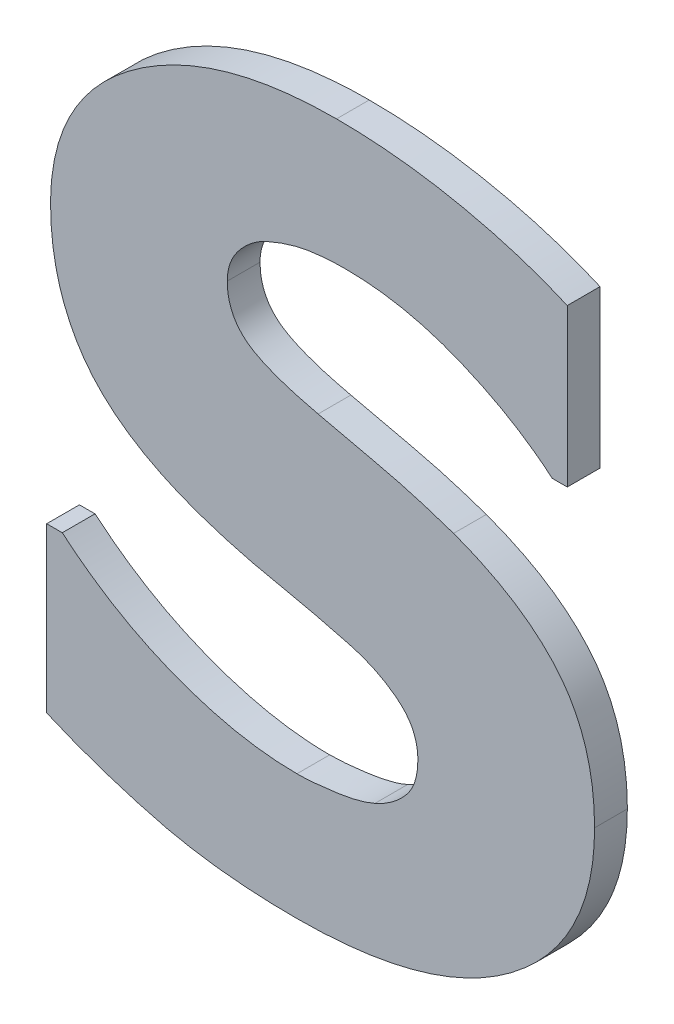
ISO-10303-21;
HEADER;
FILE_DESCRIPTION(('STEP AP214'),'2;1');
FILE_NAME('part.step','',(''),(''),'','','');
FILE_SCHEMA(('AUTOMOTIVE_DESIGN { 1 0 10303 214 1 1 1 1 }'));
ENDSEC;
DATA;
#1=APPLICATION_CONTEXT('core data for automotive mechanical design processes');
#2=APPLICATION_PROTOCOL_DEFINITION('international standard','automotive_design',2000,#1);
#3=PRODUCT_CONTEXT('',#1,'mechanical');
#4=PRODUCT('Part','Part','',(#3));
#5=PRODUCT_RELATED_PRODUCT_CATEGORY('part','',(#4));
#6=PRODUCT_DEFINITION_FORMATION('','',#4);
#7=PRODUCT_DEFINITION_CONTEXT('part definition',#1,'design');
#8=PRODUCT_DEFINITION('design','',#6,#7);
#9=PRODUCT_DEFINITION_SHAPE('','',#8);
#10=(LENGTH_UNIT() NAMED_UNIT(*) SI_UNIT(.MILLI.,.METRE.));
#11=(NAMED_UNIT(*) PLANE_ANGLE_UNIT() SI_UNIT($,.RADIAN.));
#12=(NAMED_UNIT(*) SI_UNIT($,.STERADIAN.) SOLID_ANGLE_UNIT());
#13=UNCERTAINTY_MEASURE_WITH_UNIT(LENGTH_MEASURE(1.E-05),#10,'distance_accuracy_value','');
#14=(GEOMETRIC_REPRESENTATION_CONTEXT(3) GLOBAL_UNCERTAINTY_ASSIGNED_CONTEXT((#13)) GLOBAL_UNIT_ASSIGNED_CONTEXT((#10,
#11,#12)) REPRESENTATION_CONTEXT('',''));
#15=CARTESIAN_POINT('',(0.,0.,0.));
#16=DIRECTION('',(0.,0.,1.));
#17=DIRECTION('',(1.,0.,0.));
#18=AXIS2_PLACEMENT_3D('',#15,#16,#17);
#19=CARTESIAN_POINT('',(3.989109626945,-3.1542803303733,0.0475));
#20=DIRECTION('',(-1.,0.,0.));
#21=DIRECTION('',(0.,-1.,0.));
#22=AXIS2_PLACEMENT_3D('',#19,#20,#21);
#23=PLANE('',#22);
#24=DIRECTION('',(0.,1.,0.));
#25=VECTOR('',#24,1.);
#26=CARTESIAN_POINT('',(3.989109626945,-3.1792965370477,0.0475));
#27=LINE('',#26,#25);
#28=CARTESIAN_POINT('',(3.989109626945,-3.1792965370477,0.0475));
#29=VERTEX_POINT('',#28);
#30=CARTESIAN_POINT('',(3.989109626945,-3.1542803303733,0.0475));
#31=VERTEX_POINT('',#30);
#32=EDGE_CURVE('E11',#29,#31,#27,.T.);
#33=ORIENTED_EDGE('',*,*,#32,.F.);
#34=DIRECTION('',(0.,0.,1.));
#35=VECTOR('',#34,1.);
#36=CARTESIAN_POINT('',(3.989109626945,-3.1792965370477,0.0475));
#37=LINE('',#36,#35);
#38=CARTESIAN_POINT('',(3.989109626945,-3.1792965370477,0.0525));
#39=VERTEX_POINT('',#38);
#40=EDGE_CURVE('E24',#29,#39,#37,.T.);
#41=ORIENTED_EDGE('',*,*,#40,.T.);
#42=DIRECTION('',(0.,-1.,0.));
#43=VECTOR('',#42,1.);
#44=CARTESIAN_POINT('',(3.989109626945,-3.1792965370477,0.0525));
#45=LINE('',#44,#43);
#46=CARTESIAN_POINT('',(3.989109626945,-3.1542803303733,0.0525));
#47=VERTEX_POINT('',#46);
#48=EDGE_CURVE('E172',#47,#39,#45,.T.);
#49=ORIENTED_EDGE('',*,*,#48,.F.);
#50=DIRECTION('',(0.,0.,1.));
#51=VECTOR('',#50,1.);
#52=CARTESIAN_POINT('',(3.989109626945,-3.1542803303733,0.0475));
#53=LINE('',#52,#51);
#54=EDGE_CURVE('E469',#31,#47,#53,.T.);
#55=ORIENTED_EDGE('',*,*,#54,.F.);
#56=EDGE_LOOP('',(#33,#41,#49,#55));
#57=FACE_BOUND('',#56,.T.);
#58=ADVANCED_FACE('F17',(#57),#23,.T.);
#59=CARTESIAN_POINT('',(3.9914921228187,-3.1542803303733,0.0475));
#60=DIRECTION('',(0.,1.,0.));
#61=DIRECTION('',(-1.,0.,0.));
#62=AXIS2_PLACEMENT_3D('',#59,#60,#61);
#63=PLANE('',#62);
#64=DIRECTION('',(1.,0.,0.));
#65=VECTOR('',#64,1.);
#66=CARTESIAN_POINT('',(3.989109626945,-3.1542803303733,0.0475));
#67=LINE('',#66,#65);
#68=CARTESIAN_POINT('',(3.9914921228187,-3.1542803303733,0.0475));
#69=VERTEX_POINT('',#68);
#70=EDGE_CURVE('E467',#31,#69,#67,.T.);
#71=ORIENTED_EDGE('',*,*,#70,.F.);
#72=ORIENTED_EDGE('',*,*,#54,.T.);
#73=DIRECTION('',(-1.,0.,0.));
#74=VECTOR('',#73,1.);
#75=CARTESIAN_POINT('',(3.989109626945,-3.1542803303733,0.0525));
#76=LINE('',#75,#74);
#77=CARTESIAN_POINT('',(3.9914921228187,-3.1542803303733,0.0525));
#78=VERTEX_POINT('',#77);
#79=EDGE_CURVE('E465',#78,#47,#76,.T.);
#80=ORIENTED_EDGE('',*,*,#79,.F.);
#81=DIRECTION('',(0.,0.,1.));
#82=VECTOR('',#81,1.);
#83=CARTESIAN_POINT('',(3.9914921228187,-3.1542803303733,0.0475));
#84=LINE('',#83,#82);
#85=EDGE_CURVE('E459',#69,#78,#84,.T.);
#86=ORIENTED_EDGE('',*,*,#85,.F.);
#87=EDGE_LOOP('',(#71,#72,#80,#86));
#88=FACE_BOUND('',#87,.T.);
#89=ADVANCED_FACE('F539',(#88),#63,.T.);
#90=CARTESIAN_POINT('',(4.0273146500633,-3.1682349490624,0.0475));
#91=CARTESIAN_POINT('',(4.0273146500633,-3.1682349490624,0.0525));
#92=CARTESIAN_POINT('',(4.0183802905368,-3.1682349490624,0.0475));
#93=CARTESIAN_POINT('',(4.0183802905368,-3.1682349490624,0.0525));
#94=CARTESIAN_POINT('',(3.9994054126851,-3.1610023723028,0.0475));
#95=CARTESIAN_POINT('',(3.9994054126851,-3.1610023723028,0.0525));
#96=CARTESIAN_POINT('',(3.9914921228187,-3.1542803303733,0.0475));
#97=CARTESIAN_POINT('',(3.9914921228187,-3.1542803303733,0.0525));
#98=B_SPLINE_SURFACE_WITH_KNOTS('',2,1,((#90,#91),(#92,#93),(#94,#95),(#96,#97)),.UNSPECIFIED.,
.F.,.F.,.F.,(3,1,3),(2,2),(-2.,-1.,0.),(0.,0.01),.UNSPECIFIED.);
#99=CARTESIAN_POINT('',(3.9914921228187,-3.1542803303733,0.0475));
#100=CARTESIAN_POINT('',(3.9994054126851,-3.1610023723028,0.0475));
#101=CARTESIAN_POINT('',(4.0183802905368,-3.1682349490624,0.0475));
#102=CARTESIAN_POINT('',(4.0273146500633,-3.1682349490624,0.0475));
#103=B_SPLINE_CURVE_WITH_KNOTS('',2,(#99,#100,#101,#102),.UNSPECIFIED.,.F.,.F.,(3,1,3),(0.,1.,
2.),.UNSPECIFIED.);
#104=CARTESIAN_POINT('',(4.0273146500633,-3.1682349490624,0.0475));
#105=VERTEX_POINT('',#104);
#106=EDGE_CURVE('E452',#69,#105,#103,.T.);
#107=CARTESIAN_POINT('',(4.0273146500633,-3.1682349490624,0.0525));
#108=CARTESIAN_POINT('',(4.0183802905368,-3.1682349490624,0.0525));
#109=CARTESIAN_POINT('',(3.9994054126851,-3.1610023723028,0.0525));
#110=CARTESIAN_POINT('',(3.9914921228187,-3.1542803303733,0.0525));
#111=B_SPLINE_CURVE_WITH_KNOTS('',2,(#107,#108,#109,#110),.UNSPECIFIED.,.F.,.F.,(3,1,3),(-2.,
-1.,0.),.UNSPECIFIED.);
#112=CARTESIAN_POINT('',(4.0273146500633,-3.1682349490624,0.0525));
#113=VERTEX_POINT('',#112);
#114=EDGE_CURVE('E447',#113,#78,#111,.T.);
#115=DIRECTION('',(0.,0.,1.));
#116=VECTOR('',#115,1.);
#117=CARTESIAN_POINT('',(4.0273146500633,-3.1682349490624,0.0475));
#118=LINE('',#117,#116);
#119=EDGE_CURVE('E441',#105,#113,#118,.T.);
#120=ORIENTED_EDGE('',*,*,#106,.F.);
#121=ORIENTED_EDGE('',*,*,#85,.T.);
#122=ORIENTED_EDGE('',*,*,#114,.F.);
#123=ORIENTED_EDGE('',*,*,#119,.F.);
#124=EDGE_LOOP('',(#120,#121,#122,#123));
#125=FACE_BOUND('',#124,.T.);
#126=ADVANCED_FACE('F535',(#125),#98,.T.);
#127=CARTESIAN_POINT('',(4.0392271294321,-3.1661928097421,0.0475));
#128=CARTESIAN_POINT('',(4.0392271294321,-3.1661928097421,0.0525));
#129=CARTESIAN_POINT('',(4.037014811835,-3.1672138794022,0.0475));
#130=CARTESIAN_POINT('',(4.037014811835,-3.1672138794022,0.0525));
#131=CARTESIAN_POINT('',(4.0296120567987,-3.1682349490624,0.0475));
#132=CARTESIAN_POINT('',(4.0296120567987,-3.1682349490624,0.0525));
#133=CARTESIAN_POINT('',(4.0273146500633,-3.1682349490624,0.0475));
#134=CARTESIAN_POINT('',(4.0273146500633,-3.1682349490624,0.0525));
#135=B_SPLINE_SURFACE_WITH_KNOTS('',2,1,((#127,#128),(#129,#130),(#131,#132),(#133,#134)),
.UNSPECIFIED.,.F.,.F.,.F.,(3,1,3),(2,2),(-2.,-1.,0.),(0.,0.01),.UNSPECIFIED.);
#136=CARTESIAN_POINT('',(4.0273146500633,-3.1682349490624,0.0475));
#137=CARTESIAN_POINT('',(4.0296120567987,-3.1682349490624,0.0475));
#138=CARTESIAN_POINT('',(4.037014811835,-3.1672138794022,0.0475));
#139=CARTESIAN_POINT('',(4.0392271294321,-3.1661928097421,0.0475));
#140=B_SPLINE_CURVE_WITH_KNOTS('',2,(#136,#137,#138,#139),.UNSPECIFIED.,.F.,.F.,(3,1,3),(0.,1.,
2.),.UNSPECIFIED.);
#141=CARTESIAN_POINT('',(4.0392271294321,-3.1661928097421,0.0475));
#142=VERTEX_POINT('',#141);
#143=EDGE_CURVE('E434',#105,#142,#140,.T.);
#144=CARTESIAN_POINT('',(4.0392271294321,-3.1661928097421,0.0525));
#145=CARTESIAN_POINT('',(4.037014811835,-3.1672138794022,0.0525));
#146=CARTESIAN_POINT('',(4.0296120567987,-3.1682349490624,0.0525));
#147=CARTESIAN_POINT('',(4.0273146500633,-3.1682349490624,0.0525));
#148=B_SPLINE_CURVE_WITH_KNOTS('',2,(#144,#145,#146,#147),.UNSPECIFIED.,.F.,.F.,(3,1,3),(-2.,
-1.,0.),.UNSPECIFIED.);
#149=CARTESIAN_POINT('',(4.0392271294321,-3.1661928097421,0.0525));
#150=VERTEX_POINT('',#149);
#151=EDGE_CURVE('E429',#150,#113,#148,.T.);
#152=DIRECTION('',(0.,0.,1.));
#153=VECTOR('',#152,1.);
#154=CARTESIAN_POINT('',(4.0392271294321,-3.1661928097421,0.0475));
#155=LINE('',#154,#153);
#156=EDGE_CURVE('E423',#142,#150,#155,.T.);
#157=ORIENTED_EDGE('',*,*,#143,.F.);
#158=ORIENTED_EDGE('',*,*,#119,.T.);
#159=ORIENTED_EDGE('',*,*,#151,.F.);
#160=ORIENTED_EDGE('',*,*,#156,.F.);
#161=EDGE_LOOP('',(#157,#158,#159,#160));
#162=FACE_BOUND('',#161,.T.);
#163=ADVANCED_FACE('F531',(#162),#135,.T.);
#164=CARTESIAN_POINT('',(4.0457789930849,-3.1571733610771,0.0475));
#165=CARTESIAN_POINT('',(4.0457789930849,-3.1571733610771,0.0525));
#166=CARTESIAN_POINT('',(4.0457789930849,-3.1606620157494,0.0475));
#167=CARTESIAN_POINT('',(4.0457789930849,-3.1606620157494,0.0525));
#168=CARTESIAN_POINT('',(4.0419499818592,-3.1650015618052,0.0475));
#169=CARTESIAN_POINT('',(4.0419499818592,-3.1650015618052,0.0525));
#170=CARTESIAN_POINT('',(4.0392271294321,-3.1661928097421,0.0475));
#171=CARTESIAN_POINT('',(4.0392271294321,-3.1661928097421,0.0525));
#172=B_SPLINE_SURFACE_WITH_KNOTS('',2,1,((#164,#165),(#166,#167),(#168,#169),(#170,#171)),
.UNSPECIFIED.,.F.,.F.,.F.,(3,1,3),(2,2),(-2.,-1.,0.),(0.,0.01),.UNSPECIFIED.);
#173=CARTESIAN_POINT('',(4.0392271294321,-3.1661928097421,0.0475));
#174=CARTESIAN_POINT('',(4.0419499818592,-3.1650015618052,0.0475));
#175=CARTESIAN_POINT('',(4.0457789930849,-3.1606620157494,0.0475));
#176=CARTESIAN_POINT('',(4.0457789930849,-3.1571733610771,0.0475));
#177=B_SPLINE_CURVE_WITH_KNOTS('',2,(#173,#174,#175,#176),.UNSPECIFIED.,.F.,.F.,(3,1,3),(0.,1.,
2.),.UNSPECIFIED.);
#178=CARTESIAN_POINT('',(4.0457789930849,-3.1571733610771,0.0475));
#179=VERTEX_POINT('',#178);
#180=EDGE_CURVE('E416',#142,#179,#177,.T.);
#181=CARTESIAN_POINT('',(4.0457789930849,-3.1571733610771,0.0525));
#182=CARTESIAN_POINT('',(4.0457789930849,-3.1606620157494,0.0525));
#183=CARTESIAN_POINT('',(4.0419499818592,-3.1650015618052,0.0525));
#184=CARTESIAN_POINT('',(4.0392271294321,-3.1661928097421,0.0525));
#185=B_SPLINE_CURVE_WITH_KNOTS('',2,(#181,#182,#183,#184),.UNSPECIFIED.,.F.,.F.,(3,1,3),(-2.,
-1.,0.),.UNSPECIFIED.);
#186=CARTESIAN_POINT('',(4.0457789930849,-3.1571733610771,0.0525));
#187=VERTEX_POINT('',#186);
#188=EDGE_CURVE('E411',#187,#150,#185,.T.);
#189=DIRECTION('',(0.,0.,1.));
#190=VECTOR('',#189,1.);
#191=CARTESIAN_POINT('',(4.0457789930849,-3.1571733610771,0.0475));
#192=LINE('',#191,#190);
#193=EDGE_CURVE('E405',#179,#187,#192,.T.);
#194=ORIENTED_EDGE('',*,*,#180,.F.);
#195=ORIENTED_EDGE('',*,*,#156,.T.);
#196=ORIENTED_EDGE('',*,*,#188,.F.);
#197=ORIENTED_EDGE('',*,*,#193,.F.);
#198=EDGE_LOOP('',(#194,#195,#196,#197));
#199=FACE_BOUND('',#198,.T.);
#200=ADVANCED_FACE('F527',(#199),#172,.T.);
#201=CARTESIAN_POINT('',(4.0353130290681,-3.147132842752,0.0475));
#202=CARTESIAN_POINT('',(4.0353130290681,-3.147132842752,0.0525));
#203=CARTESIAN_POINT('',(4.0395674859855,-3.1482390015506,0.0475));
#204=CARTESIAN_POINT('',(4.0395674859855,-3.1482390015506,0.0525));
#205=CARTESIAN_POINT('',(4.0457789930849,-3.1531741715748,0.0475));
#206=CARTESIAN_POINT('',(4.0457789930849,-3.1531741715748,0.0525));
#207=CARTESIAN_POINT('',(4.0457789930849,-3.1571733610771,0.0475));
#208=CARTESIAN_POINT('',(4.0457789930849,-3.1571733610771,0.0525));
#209=B_SPLINE_SURFACE_WITH_KNOTS('',2,1,((#201,#202),(#203,#204),(#205,#206),(#207,#208)),
.UNSPECIFIED.,.F.,.F.,.F.,(3,1,3),(2,2),(-2.,-1.,0.),(0.,0.01),.UNSPECIFIED.);
#210=CARTESIAN_POINT('',(4.0457789930849,-3.1571733610771,0.0475));
#211=CARTESIAN_POINT('',(4.0457789930849,-3.1531741715748,0.0475));
#212=CARTESIAN_POINT('',(4.0395674859855,-3.1482390015506,0.0475));
#213=CARTESIAN_POINT('',(4.0353130290681,-3.147132842752,0.0475));
#214=B_SPLINE_CURVE_WITH_KNOTS('',2,(#210,#211,#212,#213),.UNSPECIFIED.,.F.,.F.,(3,1,3),(0.,1.,
2.),.UNSPECIFIED.);
#215=CARTESIAN_POINT('',(4.0353130290681,-3.147132842752,0.0475));
#216=VERTEX_POINT('',#215);
#217=EDGE_CURVE('E398',#179,#216,#214,.T.);
#218=CARTESIAN_POINT('',(4.0353130290681,-3.147132842752,0.0525));
#219=CARTESIAN_POINT('',(4.0395674859855,-3.1482390015506,0.0525));
#220=CARTESIAN_POINT('',(4.0457789930849,-3.1531741715748,0.0525));
#221=CARTESIAN_POINT('',(4.0457789930849,-3.1571733610771,0.0525));
#222=B_SPLINE_CURVE_WITH_KNOTS('',2,(#218,#219,#220,#221),.UNSPECIFIED.,.F.,.F.,(3,1,3),(-2.,
-1.,0.),.UNSPECIFIED.);
#223=CARTESIAN_POINT('',(4.0353130290681,-3.147132842752,0.0525));
#224=VERTEX_POINT('',#223);
#225=EDGE_CURVE('E393',#224,#187,#222,.T.);
#226=DIRECTION('',(0.,0.,1.));
#227=VECTOR('',#226,1.);
#228=CARTESIAN_POINT('',(4.0353130290681,-3.147132842752,0.0475));
#229=LINE('',#228,#227);
#230=EDGE_CURVE('E387',#216,#224,#229,.T.);
#231=ORIENTED_EDGE('',*,*,#217,.F.);
#232=ORIENTED_EDGE('',*,*,#193,.T.);
#233=ORIENTED_EDGE('',*,*,#225,.F.);
#234=ORIENTED_EDGE('',*,*,#230,.F.);
#235=EDGE_LOOP('',(#231,#232,#233,#234));
#236=FACE_BOUND('',#235,.T.);
#237=ADVANCED_FACE('F523',(#236),#209,.T.);
#238=CARTESIAN_POINT('',(4.0124240508524,-3.1413467813444,0.0475));
#239=CARTESIAN_POINT('',(4.0124240508524,-3.1413467813444,0.0525));
#240=CARTESIAN_POINT('',(4.0177846665683,-3.143218742388,0.0475));
#241=CARTESIAN_POINT('',(4.0177846665683,-3.143218742388,0.0525));
#242=CARTESIAN_POINT('',(4.0299524133521,-3.1456863274001,0.0475));
#243=CARTESIAN_POINT('',(4.0299524133521,-3.1456863274001,0.0525));
#244=CARTESIAN_POINT('',(4.0353130290681,-3.147132842752,0.0475));
#245=CARTESIAN_POINT('',(4.0353130290681,-3.147132842752,0.0525));
#246=B_SPLINE_SURFACE_WITH_KNOTS('',2,1,((#238,#239),(#240,#241),(#242,#243),(#244,#245)),
.UNSPECIFIED.,.F.,.F.,.F.,(3,1,3),(2,2),(-2.,-1.,0.),(0.,0.01),.UNSPECIFIED.);
#247=CARTESIAN_POINT('',(4.0353130290681,-3.147132842752,0.0475));
#248=CARTESIAN_POINT('',(4.0299524133521,-3.1456863274001,0.0475));
#249=CARTESIAN_POINT('',(4.0177846665683,-3.143218742388,0.0475));
#250=CARTESIAN_POINT('',(4.0124240508524,-3.1413467813444,0.0475));
#251=B_SPLINE_CURVE_WITH_KNOTS('',2,(#247,#248,#249,#250),.UNSPECIFIED.,.F.,.F.,(3,1,3),(0.,1.,
2.),.UNSPECIFIED.);
#252=CARTESIAN_POINT('',(4.0124240508524,-3.1413467813444,0.0475));
#253=VERTEX_POINT('',#252);
#254=EDGE_CURVE('E380',#216,#253,#251,.T.);
#255=CARTESIAN_POINT('',(4.0124240508524,-3.1413467813444,0.0525));
#256=CARTESIAN_POINT('',(4.0177846665683,-3.143218742388,0.0525));
#257=CARTESIAN_POINT('',(4.0299524133521,-3.1456863274001,0.0525));
#258=CARTESIAN_POINT('',(4.0353130290681,-3.147132842752,0.0525));
#259=B_SPLINE_CURVE_WITH_KNOTS('',2,(#255,#256,#257,#258),.UNSPECIFIED.,.F.,.F.,(3,1,3),(-2.,
-1.,0.),.UNSPECIFIED.);
#260=CARTESIAN_POINT('',(4.0124240508524,-3.1413467813444,0.0525));
#261=VERTEX_POINT('',#260);
#262=EDGE_CURVE('E375',#261,#224,#259,.T.);
#263=DIRECTION('',(0.,0.,1.));
#264=VECTOR('',#263,1.);
#265=CARTESIAN_POINT('',(4.0124240508524,-3.1413467813444,0.0475));
#266=LINE('',#265,#264);
#267=EDGE_CURVE('E369',#253,#261,#266,.T.);
#268=ORIENTED_EDGE('',*,*,#254,.F.);
#269=ORIENTED_EDGE('',*,*,#230,.T.);
#270=ORIENTED_EDGE('',*,*,#262,.F.);
#271=ORIENTED_EDGE('',*,*,#267,.F.);
#272=EDGE_LOOP('',(#268,#269,#270,#271));
#273=FACE_BOUND('',#272,.T.);
#274=ADVANCED_FACE('F519',(#273),#246,.T.);
#275=CARTESIAN_POINT('',(3.9897052509134,-3.1116506720608,0.0475));
#276=CARTESIAN_POINT('',(3.9897052509134,-3.1116506720608,0.0525));
#277=CARTESIAN_POINT('',(3.9897052509134,-3.1225420817694,0.0475));
#278=CARTESIAN_POINT('',(3.9897052509134,-3.1225420817694,0.0525));
#279=CARTESIAN_POINT('',(4.0002563040686,-3.1370923244269,0.0475));
#280=CARTESIAN_POINT('',(4.0002563040686,-3.1370923244269,0.0525));
#281=CARTESIAN_POINT('',(4.0124240508524,-3.1413467813444,0.0475));
#282=CARTESIAN_POINT('',(4.0124240508524,-3.1413467813444,0.0525));
#283=B_SPLINE_SURFACE_WITH_KNOTS('',2,1,((#275,#276),(#277,#278),(#279,#280),(#281,#282)),
.UNSPECIFIED.,.F.,.F.,.F.,(3,1,3),(2,2),(-2.,-1.,0.),(0.,0.01),.UNSPECIFIED.);
#284=CARTESIAN_POINT('',(4.0124240508524,-3.1413467813444,0.0475));
#285=CARTESIAN_POINT('',(4.0002563040686,-3.1370923244269,0.0475));
#286=CARTESIAN_POINT('',(3.9897052509134,-3.1225420817694,0.0475));
#287=CARTESIAN_POINT('',(3.9897052509134,-3.1116506720608,0.0475));
#288=B_SPLINE_CURVE_WITH_KNOTS('',2,(#284,#285,#286,#287),.UNSPECIFIED.,.F.,.F.,(3,1,3),(0.,1.,
2.),.UNSPECIFIED.);
#289=CARTESIAN_POINT('',(3.9897052509134,-3.1116506720608,0.0475));
#290=VERTEX_POINT('',#289);
#291=EDGE_CURVE('E362',#253,#290,#288,.T.);
#292=CARTESIAN_POINT('',(3.9897052509134,-3.1116506720608,0.0525));
#293=CARTESIAN_POINT('',(3.9897052509134,-3.1225420817694,0.0525));
#294=CARTESIAN_POINT('',(4.0002563040686,-3.1370923244269,0.0525));
#295=CARTESIAN_POINT('',(4.0124240508524,-3.1413467813444,0.0525));
#296=B_SPLINE_CURVE_WITH_KNOTS('',2,(#292,#293,#294,#295),.UNSPECIFIED.,.F.,.F.,(3,1,3),(-2.,
-1.,0.),.UNSPECIFIED.);
#297=CARTESIAN_POINT('',(3.9897052509134,-3.1116506720608,0.0525));
#298=VERTEX_POINT('',#297);
#299=EDGE_CURVE('E357',#298,#261,#296,.T.);
#300=DIRECTION('',(0.,0.,1.));
#301=VECTOR('',#300,1.);
#302=CARTESIAN_POINT('',(3.9897052509134,-3.1116506720608,0.0475));
#303=LINE('',#302,#301);
#304=EDGE_CURVE('E351',#290,#298,#303,.T.);
#305=ORIENTED_EDGE('',*,*,#291,.F.);
#306=ORIENTED_EDGE('',*,*,#267,.T.);
#307=ORIENTED_EDGE('',*,*,#299,.F.);
#308=ORIENTED_EDGE('',*,*,#304,.F.);
#309=EDGE_LOOP('',(#305,#306,#307,#308));
#310=FACE_BOUND('',#309,.T.);
#311=ADVANCED_FACE('F515',(#310),#283,.T.);
#312=CARTESIAN_POINT('',(4.0333559788861,-3.0786360863817,0.0475));
#313=CARTESIAN_POINT('',(4.0333559788861,-3.0786360863817,0.0525));
#314=CARTESIAN_POINT('',(4.0146363684494,-3.0786360863817,0.0475));
#315=CARTESIAN_POINT('',(4.0146363684494,-3.0786360863817,0.0525));
#316=CARTESIAN_POINT('',(3.9897052509134,-3.0969302511266,0.0475));
#317=CARTESIAN_POINT('',(3.9897052509134,-3.0969302511266,0.0525));
#318=CARTESIAN_POINT('',(3.9897052509134,-3.1116506720608,0.0475));
#319=CARTESIAN_POINT('',(3.9897052509134,-3.1116506720608,0.0525));
#320=B_SPLINE_SURFACE_WITH_KNOTS('',2,1,((#312,#313),(#314,#315),(#316,#317),(#318,#319)),
.UNSPECIFIED.,.F.,.F.,.F.,(3,1,3),(2,2),(-2.,-1.,0.),(0.,0.01),.UNSPECIFIED.);
#321=CARTESIAN_POINT('',(3.9897052509134,-3.1116506720608,0.0475));
#322=CARTESIAN_POINT('',(3.9897052509134,-3.0969302511266,0.0475));
#323=CARTESIAN_POINT('',(4.0146363684494,-3.0786360863817,0.0475));
#324=CARTESIAN_POINT('',(4.0333559788861,-3.0786360863817,0.0475));
#325=B_SPLINE_CURVE_WITH_KNOTS('',2,(#321,#322,#323,#324),.UNSPECIFIED.,.F.,.F.,(3,1,3),(0.,1.,
2.),.UNSPECIFIED.);
#326=CARTESIAN_POINT('',(4.0333559788861,-3.0786360863817,0.0475));
#327=VERTEX_POINT('',#326);
#328=EDGE_CURVE('E344',#290,#327,#325,.T.);
#329=CARTESIAN_POINT('',(4.0333559788861,-3.0786360863817,0.0525));
#330=CARTESIAN_POINT('',(4.0146363684494,-3.0786360863817,0.0525));
#331=CARTESIAN_POINT('',(3.9897052509134,-3.0969302511266,0.0525));
#332=CARTESIAN_POINT('',(3.9897052509134,-3.1116506720608,0.0525));
#333=B_SPLINE_CURVE_WITH_KNOTS('',2,(#329,#330,#331,#332),.UNSPECIFIED.,.F.,.F.,(3,1,3),(-2.,
-1.,0.),.UNSPECIFIED.);
#334=CARTESIAN_POINT('',(4.0333559788861,-3.0786360863817,0.0525));
#335=VERTEX_POINT('',#334);
#336=EDGE_CURVE('E339',#335,#298,#333,.T.);
#337=DIRECTION('',(0.,0.,1.));
#338=VECTOR('',#337,1.);
#339=CARTESIAN_POINT('',(4.0333559788861,-3.0786360863817,0.0475));
#340=LINE('',#339,#338);
#341=EDGE_CURVE('E333',#327,#335,#340,.T.);
#342=ORIENTED_EDGE('',*,*,#328,.F.);
#343=ORIENTED_EDGE('',*,*,#304,.T.);
#344=ORIENTED_EDGE('',*,*,#336,.F.);
#345=ORIENTED_EDGE('',*,*,#341,.F.);
#346=EDGE_LOOP('',(#342,#343,#344,#345));
#347=FACE_BOUND('',#346,.T.);
#348=ADVANCED_FACE('F511',(#347),#320,.T.);
#349=CARTESIAN_POINT('',(4.0685828821622,-3.0856984848646,0.0475));
#350=CARTESIAN_POINT('',(4.0685828821622,-3.0856984848646,0.0525));
#351=CARTESIAN_POINT('',(4.0612652162643,-3.0824650976074,0.0475));
#352=CARTESIAN_POINT('',(4.0612652162643,-3.0824650976074,0.0525));
#353=CARTESIAN_POINT('',(4.0427157841044,-3.0786360863817,0.0475));
#354=CARTESIAN_POINT('',(4.0427157841044,-3.0786360863817,0.0525));
#355=CARTESIAN_POINT('',(4.0333559788861,-3.0786360863817,0.0475));
#356=CARTESIAN_POINT('',(4.0333559788861,-3.0786360863817,0.0525));
#357=B_SPLINE_SURFACE_WITH_KNOTS('',2,1,((#349,#350),(#351,#352),(#353,#354),(#355,#356)),
.UNSPECIFIED.,.F.,.F.,.F.,(3,1,3),(2,2),(-2.,-1.,0.),(0.,0.01),.UNSPECIFIED.);
#358=CARTESIAN_POINT('',(4.0333559788861,-3.0786360863817,0.0475));
#359=CARTESIAN_POINT('',(4.0427157841044,-3.0786360863817,0.0475));
#360=CARTESIAN_POINT('',(4.0612652162643,-3.0824650976074,0.0475));
#361=CARTESIAN_POINT('',(4.0685828821622,-3.0856984848646,0.0475));
#362=B_SPLINE_CURVE_WITH_KNOTS('',2,(#358,#359,#360,#361),.UNSPECIFIED.,.F.,.F.,(3,1,3),(0.,1.,
2.),.UNSPECIFIED.);
#363=CARTESIAN_POINT('',(4.0685828821622,-3.0856984848646,0.0475));
#364=VERTEX_POINT('',#363);
#365=EDGE_CURVE('E326',#327,#364,#362,.T.);
#366=CARTESIAN_POINT('',(4.0685828821622,-3.0856984848646,0.0525));
#367=CARTESIAN_POINT('',(4.0612652162643,-3.0824650976074,0.0525));
#368=CARTESIAN_POINT('',(4.0427157841044,-3.0786360863817,0.0525));
#369=CARTESIAN_POINT('',(4.0333559788861,-3.0786360863817,0.0525));
#370=B_SPLINE_CURVE_WITH_KNOTS('',2,(#366,#367,#368,#369),.UNSPECIFIED.,.F.,.F.,(3,1,3),(-2.,
-1.,0.),.UNSPECIFIED.);
#371=CARTESIAN_POINT('',(4.0685828821622,-3.0856984848646,0.0525));
#372=VERTEX_POINT('',#371);
#373=EDGE_CURVE('E321',#372,#335,#370,.T.);
#374=DIRECTION('',(0.,0.,1.));
#375=VECTOR('',#374,1.);
#376=CARTESIAN_POINT('',(4.0685828821622,-3.0856984848646,0.0475));
#377=LINE('',#376,#375);
#378=EDGE_CURVE('E318',#364,#372,#377,.T.);
#379=ORIENTED_EDGE('',*,*,#365,.F.);
#380=ORIENTED_EDGE('',*,*,#341,.T.);
#381=ORIENTED_EDGE('',*,*,#373,.F.);
#382=ORIENTED_EDGE('',*,*,#378,.F.);
#383=EDGE_LOOP('',(#379,#380,#381,#382));
#384=FACE_BOUND('',#383,.T.);
#385=ADVANCED_FACE('F507',(#384),#357,.T.);
#386=CARTESIAN_POINT('',(4.0685828821622,-3.1096936218788,0.0475));
#387=DIRECTION('',(1.,0.,0.));
#388=DIRECTION('',(0.,1.,0.));
#389=AXIS2_PLACEMENT_3D('',#386,#387,#388);
#390=PLANE('',#389);
#391=DIRECTION('',(0.,-1.,0.));
#392=VECTOR('',#391,1.);
#393=CARTESIAN_POINT('',(4.0685828821622,-3.0856984848646,0.0475));
#394=LINE('',#393,#392);
#395=CARTESIAN_POINT('',(4.0685828821622,-3.1096936218788,0.0475));
#396=VERTEX_POINT('',#395);
#397=EDGE_CURVE('E316',#364,#396,#394,.T.);
#398=ORIENTED_EDGE('',*,*,#397,.F.);
#399=ORIENTED_EDGE('',*,*,#378,.T.);
#400=DIRECTION('',(0.,1.,0.));
#401=VECTOR('',#400,1.);
#402=CARTESIAN_POINT('',(4.0685828821622,-3.0856984848646,0.0525));
#403=LINE('',#402,#401);
#404=CARTESIAN_POINT('',(4.0685828821622,-3.1096936218788,0.0525));
#405=VERTEX_POINT('',#404);
#406=EDGE_CURVE('E313',#405,#372,#403,.T.);
#407=ORIENTED_EDGE('',*,*,#406,.F.);
#408=DIRECTION('',(0.,0.,1.));
#409=VECTOR('',#408,1.);
#410=CARTESIAN_POINT('',(4.0685828821622,-3.1096936218788,0.0475));
#411=LINE('',#410,#409);
#412=EDGE_CURVE('E310',#396,#405,#411,.T.);
#413=ORIENTED_EDGE('',*,*,#412,.F.);
#414=EDGE_LOOP('',(#398,#399,#407,#413));
#415=FACE_BOUND('',#414,.T.);
#416=ADVANCED_FACE('F503',(#415),#390,.T.);
#417=CARTESIAN_POINT('',(4.0662854754268,-3.1096936218788,0.0475));
#418=DIRECTION('',(0.,-1.,0.));
#419=DIRECTION('',(1.,0.,0.));
#420=AXIS2_PLACEMENT_3D('',#417,#418,#419);
#421=PLANE('',#420);
#422=DIRECTION('',(-1.,0.,0.));
#423=VECTOR('',#422,1.);
#424=CARTESIAN_POINT('',(4.0685828821622,-3.1096936218788,0.0475));
#425=LINE('',#424,#423);
#426=CARTESIAN_POINT('',(4.0662854754268,-3.1096936218788,0.0475));
#427=VERTEX_POINT('',#426);
#428=EDGE_CURVE('E308',#396,#427,#425,.T.);
#429=ORIENTED_EDGE('',*,*,#428,.F.);
#430=ORIENTED_EDGE('',*,*,#412,.T.);
#431=DIRECTION('',(1.,0.,0.));
#432=VECTOR('',#431,1.);
#433=CARTESIAN_POINT('',(4.0685828821622,-3.1096936218788,0.0525));
#434=LINE('',#433,#432);
#435=CARTESIAN_POINT('',(4.0662854754268,-3.1096936218788,0.0525));
#436=VERTEX_POINT('',#435);
#437=EDGE_CURVE('E305',#436,#405,#434,.T.);
#438=ORIENTED_EDGE('',*,*,#437,.F.);
#439=DIRECTION('',(0.,0.,1.));
#440=VECTOR('',#439,1.);
#441=CARTESIAN_POINT('',(4.0662854754268,-3.1096936218788,0.0475));
#442=LINE('',#441,#440);
#443=EDGE_CURVE('E299',#427,#436,#442,.T.);
#444=ORIENTED_EDGE('',*,*,#443,.F.);
#445=EDGE_LOOP('',(#429,#430,#438,#444));
#446=FACE_BOUND('',#445,.T.);
#447=ADVANCED_FACE('F499',(#446),#421,.T.);
#448=CARTESIAN_POINT('',(4.0347174050996,-3.09778114251,0.0475));
#449=CARTESIAN_POINT('',(4.0347174050996,-3.09778114251,0.0525));
#450=CARTESIAN_POINT('',(4.0435666754878,-3.09778114251,0.0475));
#451=CARTESIAN_POINT('',(4.0435666754878,-3.09778114251,0.0525));
#452=CARTESIAN_POINT('',(4.0604143248808,-3.1046733627163,0.0475));
#453=CARTESIAN_POINT('',(4.0604143248808,-3.1046733627163,0.0525));
#454=CARTESIAN_POINT('',(4.0662854754268,-3.1096936218788,0.0475));
#455=CARTESIAN_POINT('',(4.0662854754268,-3.1096936218788,0.0525));
#456=B_SPLINE_SURFACE_WITH_KNOTS('',2,1,((#448,#449),(#450,#451),(#452,#453),(#454,#455)),
.UNSPECIFIED.,.F.,.F.,.F.,(3,1,3),(2,2),(-2.,-1.,0.),(0.,0.01),.UNSPECIFIED.);
#457=CARTESIAN_POINT('',(4.0662854754268,-3.1096936218788,0.0475));
#458=CARTESIAN_POINT('',(4.0604143248808,-3.1046733627163,0.0475));
#459=CARTESIAN_POINT('',(4.0435666754878,-3.09778114251,0.0475));
#460=CARTESIAN_POINT('',(4.0347174050996,-3.09778114251,0.0475));
#461=B_SPLINE_CURVE_WITH_KNOTS('',2,(#457,#458,#459,#460),.UNSPECIFIED.,.F.,.F.,(3,1,3),(0.,1.,
2.),.UNSPECIFIED.);
#462=CARTESIAN_POINT('',(4.0347174050996,-3.09778114251,0.0475));
#463=VERTEX_POINT('',#462);
#464=EDGE_CURVE('E292',#427,#463,#461,.T.);
#465=CARTESIAN_POINT('',(4.0347174050996,-3.09778114251,0.0525));
#466=CARTESIAN_POINT('',(4.0435666754878,-3.09778114251,0.0525));
#467=CARTESIAN_POINT('',(4.0604143248808,-3.1046733627163,0.0525));
#468=CARTESIAN_POINT('',(4.0662854754268,-3.1096936218788,0.0525));
#469=B_SPLINE_CURVE_WITH_KNOTS('',2,(#465,#466,#467,#468),.UNSPECIFIED.,.F.,.F.,(3,1,3),(-2.,
-1.,0.),.UNSPECIFIED.);
#470=CARTESIAN_POINT('',(4.0347174050996,-3.09778114251,0.0525));
#471=VERTEX_POINT('',#470);
#472=EDGE_CURVE('E287',#471,#436,#469,.T.);
#473=DIRECTION('',(0.,0.,1.));
#474=VECTOR('',#473,1.);
#475=CARTESIAN_POINT('',(4.0347174050996,-3.09778114251,0.0475));
#476=LINE('',#475,#474);
#477=EDGE_CURVE('E281',#463,#471,#476,.T.);
#478=ORIENTED_EDGE('',*,*,#464,.F.);
#479=ORIENTED_EDGE('',*,*,#443,.T.);
#480=ORIENTED_EDGE('',*,*,#472,.F.);
#481=ORIENTED_EDGE('',*,*,#477,.F.);
#482=EDGE_LOOP('',(#478,#479,#480,#481));
#483=FACE_BOUND('',#482,.T.);
#484=ADVANCED_FACE('F495',(#483),#456,.T.);
#485=CARTESIAN_POINT('',(4.0227198365925,-3.1001636383838,0.0475));
#486=CARTESIAN_POINT('',(4.0227198365925,-3.1001636383838,0.0525));
#487=CARTESIAN_POINT('',(4.0257830455731,-3.0988022121702,0.0475));
#488=CARTESIAN_POINT('',(4.0257830455731,-3.0988022121702,0.0525));
#489=CARTESIAN_POINT('',(4.0312287504273,-3.09778114251,0.0475));
#490=CARTESIAN_POINT('',(4.0312287504273,-3.09778114251,0.0525));
#491=CARTESIAN_POINT('',(4.0347174050996,-3.09778114251,0.0475));
#492=CARTESIAN_POINT('',(4.0347174050996,-3.09778114251,0.0525));
#493=B_SPLINE_SURFACE_WITH_KNOTS('',2,1,((#485,#486),(#487,#488),(#489,#490),(#491,#492)),
.UNSPECIFIED.,.F.,.F.,.F.,(3,1,3),(2,2),(-2.,-1.,0.),(0.,0.01),.UNSPECIFIED.);
#494=CARTESIAN_POINT('',(4.0347174050996,-3.09778114251,0.0475));
#495=CARTESIAN_POINT('',(4.0312287504273,-3.09778114251,0.0475));
#496=CARTESIAN_POINT('',(4.0257830455731,-3.0988022121702,0.0475));
#497=CARTESIAN_POINT('',(4.0227198365925,-3.1001636383838,0.0475));
#498=B_SPLINE_CURVE_WITH_KNOTS('',2,(#494,#495,#496,#497),.UNSPECIFIED.,.F.,.F.,(3,1,3),(0.,1.,
2.),.UNSPECIFIED.);
#499=CARTESIAN_POINT('',(4.0227198365925,-3.1001636383838,0.0475));
#500=VERTEX_POINT('',#499);
#501=EDGE_CURVE('E274',#463,#500,#498,.T.);
#502=CARTESIAN_POINT('',(4.0227198365925,-3.1001636383838,0.0525));
#503=CARTESIAN_POINT('',(4.0257830455731,-3.0988022121702,0.0525));
#504=CARTESIAN_POINT('',(4.0312287504273,-3.09778114251,0.0525));
#505=CARTESIAN_POINT('',(4.0347174050996,-3.09778114251,0.0525));
#506=B_SPLINE_CURVE_WITH_KNOTS('',2,(#502,#503,#504,#505),.UNSPECIFIED.,.F.,.F.,(3,1,3),(-2.,
-1.,0.),.UNSPECIFIED.);
#507=CARTESIAN_POINT('',(4.0227198365925,-3.1001636383838,0.0525));
#508=VERTEX_POINT('',#507);
#509=EDGE_CURVE('E269',#508,#471,#506,.T.);
#510=DIRECTION('',(0.,0.,1.));
#511=VECTOR('',#510,1.);
#512=CARTESIAN_POINT('',(4.0227198365925,-3.1001636383838,0.0475));
#513=LINE('',#512,#511);
#514=EDGE_CURVE('E263',#500,#508,#513,.T.);
#515=ORIENTED_EDGE('',*,*,#501,.F.);
#516=ORIENTED_EDGE('',*,*,#477,.T.);
#517=ORIENTED_EDGE('',*,*,#509,.F.);
#518=ORIENTED_EDGE('',*,*,#514,.F.);
#519=EDGE_LOOP('',(#515,#516,#517,#518));
#520=FACE_BOUND('',#519,.T.);
#521=ADVANCED_FACE('F491',(#520),#493,.T.);
#522=CARTESIAN_POINT('',(4.0166785077698,-3.1084172848036,0.0475));
#523=CARTESIAN_POINT('',(4.0166785077698,-3.1084172848036,0.0525));
#524=CARTESIAN_POINT('',(4.0166785077698,-3.1056944323764,0.0475));
#525=CARTESIAN_POINT('',(4.0166785077698,-3.1056944323764,0.0525));
#526=CARTESIAN_POINT('',(4.0202522515804,-3.1012697971823,0.0475));
#527=CARTESIAN_POINT('',(4.0202522515804,-3.1012697971823,0.0525));
#528=CARTESIAN_POINT('',(4.0227198365925,-3.1001636383838,0.0475));
#529=CARTESIAN_POINT('',(4.0227198365925,-3.1001636383838,0.0525));
#530=B_SPLINE_SURFACE_WITH_KNOTS('',2,1,((#522,#523),(#524,#525),(#526,#527),(#528,#529)),
.UNSPECIFIED.,.F.,.F.,.F.,(3,1,3),(2,2),(-2.,-1.,0.),(0.,0.01),.UNSPECIFIED.);
#531=CARTESIAN_POINT('',(4.0227198365925,-3.1001636383838,0.0475));
#532=CARTESIAN_POINT('',(4.0202522515804,-3.1012697971823,0.0475));
#533=CARTESIAN_POINT('',(4.0166785077698,-3.1056944323764,0.0475));
#534=CARTESIAN_POINT('',(4.0166785077698,-3.1084172848036,0.0475));
#535=B_SPLINE_CURVE_WITH_KNOTS('',2,(#531,#532,#533,#534),.UNSPECIFIED.,.F.,.F.,(3,1,3),(0.,1.,
2.),.UNSPECIFIED.);
#536=CARTESIAN_POINT('',(4.0166785077698,-3.1084172848036,0.0475));
#537=VERTEX_POINT('',#536);
#538=EDGE_CURVE('E256',#500,#537,#535,.T.);
#539=CARTESIAN_POINT('',(4.0166785077698,-3.1084172848036,0.0525));
#540=CARTESIAN_POINT('',(4.0166785077698,-3.1056944323764,0.0525));
#541=CARTESIAN_POINT('',(4.0202522515804,-3.1012697971823,0.0525));
#542=CARTESIAN_POINT('',(4.0227198365925,-3.1001636383838,0.0525));
#543=B_SPLINE_CURVE_WITH_KNOTS('',2,(#539,#540,#541,#542),.UNSPECIFIED.,.F.,.F.,(3,1,3),(-2.,
-1.,0.),.UNSPECIFIED.);
#544=CARTESIAN_POINT('',(4.0166785077698,-3.1084172848036,0.0525));
#545=VERTEX_POINT('',#544);
#546=EDGE_CURVE('E251',#545,#508,#543,.T.);
#547=DIRECTION('',(0.,0.,1.));
#548=VECTOR('',#547,1.);
#549=CARTESIAN_POINT('',(4.0166785077698,-3.1084172848036,0.0475));
#550=LINE('',#549,#548);
#551=EDGE_CURVE('E245',#537,#545,#550,.T.);
#552=ORIENTED_EDGE('',*,*,#538,.F.);
#553=ORIENTED_EDGE('',*,*,#514,.T.);
#554=ORIENTED_EDGE('',*,*,#546,.F.);
#555=ORIENTED_EDGE('',*,*,#551,.F.);
#556=EDGE_LOOP('',(#552,#553,#554,#555));
#557=FACE_BOUND('',#556,.T.);
#558=ADVANCED_FACE('F487',(#557),#530,.T.);
#559=CARTESIAN_POINT('',(4.0305480373206,-3.1190534270971,0.0475));
#560=CARTESIAN_POINT('',(4.0305480373206,-3.1190534270971,0.0525));
#561=CARTESIAN_POINT('',(4.0223794800391,-3.1171814660535,0.0475));
#562=CARTESIAN_POINT('',(4.0223794800391,-3.1171814660535,0.0525));
#563=CARTESIAN_POINT('',(4.0166785077698,-3.1125015634443,0.0475));
#564=CARTESIAN_POINT('',(4.0166785077698,-3.1125015634443,0.0525));
#565=CARTESIAN_POINT('',(4.0166785077698,-3.1084172848036,0.0475));
#566=CARTESIAN_POINT('',(4.0166785077698,-3.1084172848036,0.0525));
#567=B_SPLINE_SURFACE_WITH_KNOTS('',2,1,((#559,#560),(#561,#562),(#563,#564),(#565,#566)),
.UNSPECIFIED.,.F.,.F.,.F.,(3,1,3),(2,2),(-2.,-1.,0.),(0.,0.01),.UNSPECIFIED.);
#568=CARTESIAN_POINT('',(4.0166785077698,-3.1084172848036,0.0475));
#569=CARTESIAN_POINT('',(4.0166785077698,-3.1125015634443,0.0475));
#570=CARTESIAN_POINT('',(4.0223794800391,-3.1171814660535,0.0475));
#571=CARTESIAN_POINT('',(4.0305480373206,-3.1190534270971,0.0475));
#572=B_SPLINE_CURVE_WITH_KNOTS('',2,(#568,#569,#570,#571),.UNSPECIFIED.,.F.,.F.,(3,1,3),(0.,1.,
2.),.UNSPECIFIED.);
#573=CARTESIAN_POINT('',(4.0305480373206,-3.1190534270971,0.0475));
#574=VERTEX_POINT('',#573);
#575=EDGE_CURVE('E238',#537,#574,#572,.T.);
#576=CARTESIAN_POINT('',(4.0305480373206,-3.1190534270971,0.0525));
#577=CARTESIAN_POINT('',(4.0223794800391,-3.1171814660535,0.0525));
#578=CARTESIAN_POINT('',(4.0166785077698,-3.1125015634443,0.0525));
#579=CARTESIAN_POINT('',(4.0166785077698,-3.1084172848036,0.0525));
#580=B_SPLINE_CURVE_WITH_KNOTS('',2,(#576,#577,#578,#579),.UNSPECIFIED.,.F.,.F.,(3,1,3),(-2.,
-1.,0.),.UNSPECIFIED.);
#581=CARTESIAN_POINT('',(4.0305480373206,-3.1190534270971,0.0525));
#582=VERTEX_POINT('',#581);
#583=EDGE_CURVE('E233',#582,#545,#580,.T.);
#584=DIRECTION('',(0.,0.,1.));
#585=VECTOR('',#584,1.);
#586=CARTESIAN_POINT('',(4.0305480373206,-3.1190534270971,0.0475));
#587=LINE('',#586,#585);
#588=EDGE_CURVE('E227',#574,#582,#587,.T.);
#589=ORIENTED_EDGE('',*,*,#575,.F.);
#590=ORIENTED_EDGE('',*,*,#551,.T.);
#591=ORIENTED_EDGE('',*,*,#583,.F.);
#592=ORIENTED_EDGE('',*,*,#588,.F.);
#593=EDGE_LOOP('',(#589,#590,#591,#592));
#594=FACE_BOUND('',#593,.T.);
#595=ADVANCED_FACE('F483',(#594),#567,.T.);
#596=CARTESIAN_POINT('',(4.0512246979392,-3.1244991319514,0.0475));
#597=CARTESIAN_POINT('',(4.0512246979392,-3.1244991319514,0.0525));
#598=CARTESIAN_POINT('',(4.0456088148082,-3.1225420817694,0.0475));
#599=CARTESIAN_POINT('',(4.0456088148082,-3.1225420817694,0.0525));
#600=CARTESIAN_POINT('',(4.0358235638982,-3.120244675034,0.0475));
#601=CARTESIAN_POINT('',(4.0358235638982,-3.120244675034,0.0525));
#602=CARTESIAN_POINT('',(4.0305480373206,-3.1190534270971,0.0475));
#603=CARTESIAN_POINT('',(4.0305480373206,-3.1190534270971,0.0525));
#604=B_SPLINE_SURFACE_WITH_KNOTS('',2,1,((#596,#597),(#598,#599),(#600,#601),(#602,#603)),
.UNSPECIFIED.,.F.,.F.,.F.,(3,1,3),(2,2),(-2.,-1.,0.),(0.,0.01),.UNSPECIFIED.);
#605=CARTESIAN_POINT('',(4.0305480373206,-3.1190534270971,0.0475));
#606=CARTESIAN_POINT('',(4.0358235638982,-3.120244675034,0.0475));
#607=CARTESIAN_POINT('',(4.0456088148082,-3.1225420817694,0.0475));
#608=CARTESIAN_POINT('',(4.0512246979392,-3.1244991319514,0.0475));
#609=B_SPLINE_CURVE_WITH_KNOTS('',2,(#605,#606,#607,#608),.UNSPECIFIED.,.F.,.F.,(3,1,3),(0.,1.,
2.),.UNSPECIFIED.);
#610=CARTESIAN_POINT('',(4.0512246979392,-3.1244991319514,0.0475));
#611=VERTEX_POINT('',#610);
#612=EDGE_CURVE('E220',#574,#611,#609,.T.);
#613=CARTESIAN_POINT('',(4.0512246979392,-3.1244991319514,0.0525));
#614=CARTESIAN_POINT('',(4.0456088148082,-3.1225420817694,0.0525));
#615=CARTESIAN_POINT('',(4.0358235638982,-3.120244675034,0.0525));
#616=CARTESIAN_POINT('',(4.0305480373206,-3.1190534270971,0.0525));
#617=B_SPLINE_CURVE_WITH_KNOTS('',2,(#613,#614,#615,#616),.UNSPECIFIED.,.F.,.F.,(3,1,3),(-2.,
-1.,0.),.UNSPECIFIED.);
#618=CARTESIAN_POINT('',(4.0512246979392,-3.1244991319514,0.0525));
#619=VERTEX_POINT('',#618);
#620=EDGE_CURVE('E215',#619,#582,#617,.T.);
#621=DIRECTION('',(0.,0.,1.));
#622=VECTOR('',#621,1.);
#623=CARTESIAN_POINT('',(4.0512246979392,-3.1244991319514,0.0475));
#624=LINE('',#623,#622);
#625=EDGE_CURVE('E209',#611,#619,#624,.T.);
#626=ORIENTED_EDGE('',*,*,#612,.F.);
#627=ORIENTED_EDGE('',*,*,#588,.T.);
#628=ORIENTED_EDGE('',*,*,#620,.F.);
#629=ORIENTED_EDGE('',*,*,#625,.F.);
#630=EDGE_LOOP('',(#626,#627,#628,#629));
#631=FACE_BOUND('',#630,.T.);
#632=ADVANCED_FACE('F479',(#631),#604,.T.);
#633=CARTESIAN_POINT('',(4.0727522499413,-3.1526636367447,0.0475));
#634=CARTESIAN_POINT('',(4.0727522499413,-3.1526636367447,0.0525));
#635=CARTESIAN_POINT('',(4.0727522499413,-3.1417722270361,0.0475));
#636=CARTESIAN_POINT('',(4.0727522499413,-3.1417722270361,0.0525));
#637=CARTESIAN_POINT('',(4.0621161076478,-3.1284983214538,0.0475));
#638=CARTESIAN_POINT('',(4.0621161076478,-3.1284983214538,0.0525));
#639=CARTESIAN_POINT('',(4.0512246979392,-3.1244991319514,0.0475));
#640=CARTESIAN_POINT('',(4.0512246979392,-3.1244991319514,0.0525));
#641=B_SPLINE_SURFACE_WITH_KNOTS('',2,1,((#633,#634),(#635,#636),(#637,#638),(#639,#640)),
.UNSPECIFIED.,.F.,.F.,.F.,(3,1,3),(2,2),(-2.,-1.,0.),(0.,0.01),.UNSPECIFIED.);
#642=CARTESIAN_POINT('',(4.0512246979392,-3.1244991319514,0.0475));
#643=CARTESIAN_POINT('',(4.0621161076478,-3.1284983214538,0.0475));
#644=CARTESIAN_POINT('',(4.0727522499413,-3.1417722270361,0.0475));
#645=CARTESIAN_POINT('',(4.0727522499413,-3.1526636367447,0.0475));
#646=B_SPLINE_CURVE_WITH_KNOTS('',2,(#642,#643,#644,#645),.UNSPECIFIED.,.F.,.F.,(3,1,3),(0.,1.,
2.),.UNSPECIFIED.);
#647=CARTESIAN_POINT('',(4.0727522499413,-3.1526636367447,0.0475));
#648=VERTEX_POINT('',#647);
#649=EDGE_CURVE('E202',#611,#648,#646,.T.);
#650=CARTESIAN_POINT('',(4.0727522499413,-3.1526636367447,0.0525));
#651=CARTESIAN_POINT('',(4.0727522499413,-3.1417722270361,0.0525));
#652=CARTESIAN_POINT('',(4.0621161076478,-3.1284983214538,0.0525));
#653=CARTESIAN_POINT('',(4.0512246979392,-3.1244991319514,0.0525));
#654=B_SPLINE_CURVE_WITH_KNOTS('',2,(#650,#651,#652,#653),.UNSPECIFIED.,.F.,.F.,(3,1,3),(-2.,
-1.,0.),.UNSPECIFIED.);
#655=CARTESIAN_POINT('',(4.0727522499413,-3.1526636367447,0.0525));
#656=VERTEX_POINT('',#655);
#657=EDGE_CURVE('E198',#656,#619,#654,.T.);
#658=DIRECTION('',(0.,0.,1.));
#659=VECTOR('',#658,1.);
#660=CARTESIAN_POINT('',(4.0727522499413,-3.1526636367447,0.0475));
#661=LINE('',#660,#659);
#662=EDGE_CURVE('E157',#648,#656,#661,.T.);
#663=ORIENTED_EDGE('',*,*,#649,.F.);
#664=ORIENTED_EDGE('',*,*,#625,.T.);
#665=ORIENTED_EDGE('',*,*,#657,.F.);
#666=ORIENTED_EDGE('',*,*,#662,.F.);
#667=EDGE_LOOP('',(#663,#664,#665,#666));
#668=FACE_BOUND('',#667,.T.);
#669=ADVANCED_FACE('F477',(#668),#641,.T.);
#670=CARTESIAN_POINT('',(4.027229560925,-3.1873800051908,0.0475));
#671=CARTESIAN_POINT('',(4.027229560925,-3.1873800051908,0.0525));
#672=CARTESIAN_POINT('',(4.0481614889587,-3.1873800051908,0.0475));
#673=CARTESIAN_POINT('',(4.0481614889587,-3.1873800051908,0.0525));
#674=CARTESIAN_POINT('',(4.0727522499413,-3.1683200382008,0.0475));
#675=CARTESIAN_POINT('',(4.0727522499413,-3.1683200382008,0.0525));
#676=CARTESIAN_POINT('',(4.0727522499413,-3.1526636367447,0.0475));
#677=CARTESIAN_POINT('',(4.0727522499413,-3.1526636367447,0.0525));
#678=B_SPLINE_SURFACE_WITH_KNOTS('',2,1,((#670,#671),(#672,#673),(#674,#675),(#676,#677)),
.UNSPECIFIED.,.F.,.F.,.F.,(3,1,3),(2,2),(-2.,-1.,0.),(0.,0.01),.UNSPECIFIED.);
#679=CARTESIAN_POINT('',(4.0727522499413,-3.1526636367447,0.0475));
#680=CARTESIAN_POINT('',(4.0727522499413,-3.1683200382008,0.0475));
#681=CARTESIAN_POINT('',(4.0481614889587,-3.1873800051908,0.0475));
#682=CARTESIAN_POINT('',(4.027229560925,-3.1873800051908,0.0475));
#683=B_SPLINE_CURVE_WITH_KNOTS('',2,(#679,#680,#681,#682),.UNSPECIFIED.,.F.,.F.,(3,1,3),(0.,1.,
2.),.UNSPECIFIED.);
#684=CARTESIAN_POINT('',(4.027229560925,-3.1873800051908,0.0475));
#685=VERTEX_POINT('',#684);
#686=EDGE_CURVE('E161',#648,#685,#683,.T.);
#687=CARTESIAN_POINT('',(4.027229560925,-3.1873800051908,0.0525));
#688=CARTESIAN_POINT('',(4.0481614889587,-3.1873800051908,0.0525));
#689=CARTESIAN_POINT('',(4.0727522499413,-3.1683200382008,0.0525));
#690=CARTESIAN_POINT('',(4.0727522499413,-3.1526636367447,0.0525));
#691=B_SPLINE_CURVE_WITH_KNOTS('',2,(#687,#688,#689,#690),.UNSPECIFIED.,.F.,.F.,(3,1,3),(-2.,
-1.,0.),.UNSPECIFIED.);
#692=CARTESIAN_POINT('',(4.027229560925,-3.1873800051908,0.0525));
#693=VERTEX_POINT('',#692);
#694=EDGE_CURVE('E150',#693,#656,#691,.T.);
#695=DIRECTION('',(0.,0.,1.));
#696=VECTOR('',#695,1.);
#697=CARTESIAN_POINT('',(4.027229560925,-3.1873800051908,0.0475));
#698=LINE('',#697,#696);
#699=EDGE_CURVE('E154',#685,#693,#698,.T.);
#700=ORIENTED_EDGE('',*,*,#686,.F.);
#701=ORIENTED_EDGE('',*,*,#662,.T.);
#702=ORIENTED_EDGE('',*,*,#694,.F.);
#703=ORIENTED_EDGE('',*,*,#699,.F.);
#704=EDGE_LOOP('',(#700,#701,#702,#703));
#705=FACE_BOUND('',#704,.T.);
#706=ADVANCED_FACE('F153',(#705),#678,.T.);
#707=CARTESIAN_POINT('',(3.989109626945,-3.1792965370477,0.0475));
#708=CARTESIAN_POINT('',(3.989109626945,-3.1792965370477,0.0525));
#709=CARTESIAN_POINT('',(3.996937827673,-3.1827001025816,0.0475));
#710=CARTESIAN_POINT('',(3.996937827673,-3.1827001025816,0.0525));
#711=CARTESIAN_POINT('',(4.0151469032795,-3.1873800051908,0.0475));
#712=CARTESIAN_POINT('',(4.0151469032795,-3.1873800051908,0.0525));
#713=CARTESIAN_POINT('',(4.027229560925,-3.1873800051908,0.0475));
#714=CARTESIAN_POINT('',(4.027229560925,-3.1873800051908,0.0525));
#715=B_SPLINE_SURFACE_WITH_KNOTS('',2,1,((#707,#708),(#709,#710),(#711,#712),(#713,#714)),
.UNSPECIFIED.,.F.,.F.,.F.,(3,1,3),(2,2),(-2.,-1.,0.),(0.,0.01),.UNSPECIFIED.);
#716=CARTESIAN_POINT('',(4.027229560925,-3.1873800051908,0.0475));
#717=CARTESIAN_POINT('',(4.0151469032795,-3.1873800051908,0.0475));
#718=CARTESIAN_POINT('',(3.996937827673,-3.1827001025816,0.0475));
#719=CARTESIAN_POINT('',(3.989109626945,-3.1792965370477,0.0475));
#720=B_SPLINE_CURVE_WITH_KNOTS('',2,(#716,#717,#718,#719),.UNSPECIFIED.,.F.,.F.,(3,1,3),(0.,1.,
2.),.UNSPECIFIED.);
#721=EDGE_CURVE('E167',#685,#29,#720,.T.);
#722=CARTESIAN_POINT('',(3.989109626945,-3.1792965370477,0.0525));
#723=CARTESIAN_POINT('',(3.996937827673,-3.1827001025816,0.0525));
#724=CARTESIAN_POINT('',(4.0151469032795,-3.1873800051908,0.0525));
#725=CARTESIAN_POINT('',(4.027229560925,-3.1873800051908,0.0525));
#726=B_SPLINE_CURVE_WITH_KNOTS('',2,(#722,#723,#724,#725),.UNSPECIFIED.,.F.,.F.,(3,1,3),(-2.,
-1.,0.),.UNSPECIFIED.);
#727=EDGE_CURVE('E166',#39,#693,#726,.T.);
#728=ORIENTED_EDGE('',*,*,#721,.F.);
#729=ORIENTED_EDGE('',*,*,#699,.T.);
#730=ORIENTED_EDGE('',*,*,#727,.F.);
#731=ORIENTED_EDGE('',*,*,#40,.F.);
#732=EDGE_LOOP('',(#728,#729,#730,#731));
#733=FACE_BOUND('',#732,.T.);
#734=ADVANCED_FACE('F165',(#733),#715,.T.);
#735=CARTESIAN_POINT('',(4.0301305133259,-3.1336102368119,0.0475));
#736=DIRECTION('',(0.,0.,1.));
#737=DIRECTION('',(1.,0.,0.));
#738=AXIS2_PLACEMENT_3D('',#735,#736,#737);
#739=PLANE('',#738);
#740=ORIENTED_EDGE('',*,*,#721,.T.);
#741=ORIENTED_EDGE('',*,*,#32,.T.);
#742=ORIENTED_EDGE('',*,*,#70,.T.);
#743=ORIENTED_EDGE('',*,*,#106,.T.);
#744=ORIENTED_EDGE('',*,*,#143,.T.);
#745=ORIENTED_EDGE('',*,*,#180,.T.);
#746=ORIENTED_EDGE('',*,*,#217,.T.);
#747=ORIENTED_EDGE('',*,*,#254,.T.);
#748=ORIENTED_EDGE('',*,*,#291,.T.);
#749=ORIENTED_EDGE('',*,*,#328,.T.);
#750=ORIENTED_EDGE('',*,*,#365,.T.);
#751=ORIENTED_EDGE('',*,*,#397,.T.);
#752=ORIENTED_EDGE('',*,*,#428,.T.);
#753=ORIENTED_EDGE('',*,*,#464,.T.);
#754=ORIENTED_EDGE('',*,*,#501,.T.);
#755=ORIENTED_EDGE('',*,*,#538,.T.);
#756=ORIENTED_EDGE('',*,*,#575,.T.);
#757=ORIENTED_EDGE('',*,*,#612,.T.);
#758=ORIENTED_EDGE('',*,*,#649,.T.);
#759=ORIENTED_EDGE('',*,*,#686,.T.);
#760=EDGE_LOOP('',(#740,#741,#742,#743,#744,#745,#746,#747,#748,#749,#750,#751,#752,#753,#754,
#755,#756,#757,#758,#759));
#761=FACE_BOUND('',#760,.T.);
#762=ADVANCED_FACE('F472',(#761),#739,.F.);
#763=CARTESIAN_POINT('',(4.0301305133259,-3.1336102368119,0.0525));
#764=DIRECTION('',(0.,0.,1.));
#765=DIRECTION('',(1.,0.,0.));
#766=AXIS2_PLACEMENT_3D('',#763,#764,#765);
#767=PLANE('',#766);
#768=ORIENTED_EDGE('',*,*,#727,.T.);
#769=ORIENTED_EDGE('',*,*,#694,.T.);
#770=ORIENTED_EDGE('',*,*,#657,.T.);
#771=ORIENTED_EDGE('',*,*,#620,.T.);
#772=ORIENTED_EDGE('',*,*,#583,.T.);
#773=ORIENTED_EDGE('',*,*,#546,.T.);
#774=ORIENTED_EDGE('',*,*,#509,.T.);
#775=ORIENTED_EDGE('',*,*,#472,.T.);
#776=ORIENTED_EDGE('',*,*,#437,.T.);
#777=ORIENTED_EDGE('',*,*,#406,.T.);
#778=ORIENTED_EDGE('',*,*,#373,.T.);
#779=ORIENTED_EDGE('',*,*,#336,.T.);
#780=ORIENTED_EDGE('',*,*,#299,.T.);
#781=ORIENTED_EDGE('',*,*,#262,.T.);
#782=ORIENTED_EDGE('',*,*,#225,.T.);
#783=ORIENTED_EDGE('',*,*,#188,.T.);
#784=ORIENTED_EDGE('',*,*,#151,.T.);
#785=ORIENTED_EDGE('',*,*,#114,.T.);
#786=ORIENTED_EDGE('',*,*,#79,.T.);
#787=ORIENTED_EDGE('',*,*,#48,.T.);
#788=EDGE_LOOP('',(#768,#769,#770,#771,#772,#773,#774,#775,#776,#777,#778,#779,#780,#781,#782,
#783,#784,#785,#786,#787));
#789=FACE_BOUND('',#788,.T.);
#790=ADVANCED_FACE('F170',(#789),#767,.T.);
#791=CLOSED_SHELL('',(#58,#89,#126,#163,#200,#237,#274,#311,#348,#385,#416,#447,#484,#521,#558,
#595,#632,#669,#706,#734,#762,#790));
#792=MANIFOLD_SOLID_BREP('B1',#791);
#793=ADVANCED_BREP_SHAPE_REPRESENTATION('',(#18,#792),#14);
#794=SHAPE_DEFINITION_REPRESENTATION(#9,#793);
ENDSEC;
END-ISO-10303-21;
